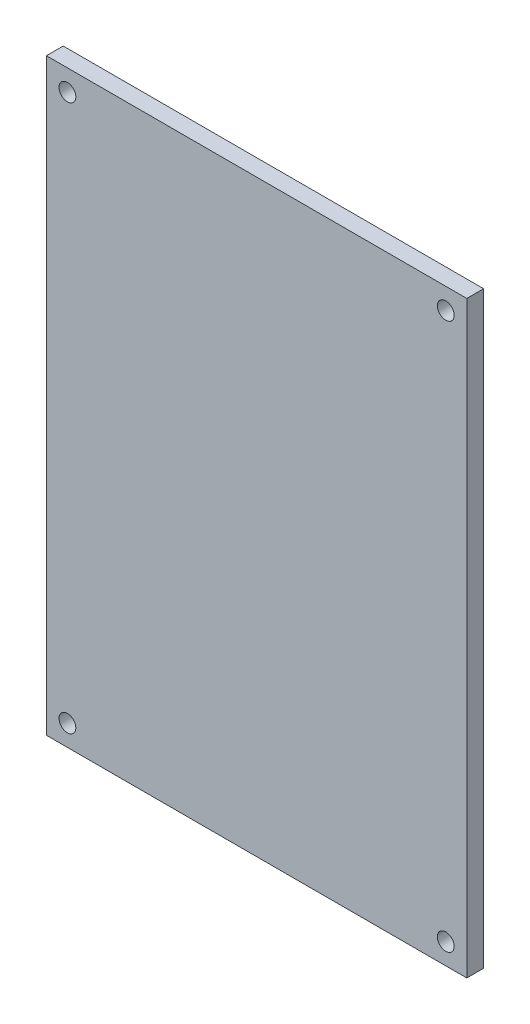
ISO-10303-21;
HEADER;
FILE_DESCRIPTION(('STEP AP214'),'2;1');
FILE_NAME('part.step','',(''),(''),'','','');
FILE_SCHEMA(('AUTOMOTIVE_DESIGN { 1 0 10303 214 1 1 1 1 }'));
ENDSEC;
DATA;
#1=APPLICATION_CONTEXT('core data for automotive mechanical design processes');
#2=APPLICATION_PROTOCOL_DEFINITION('international standard','automotive_design',2000,#1);
#3=PRODUCT_CONTEXT('',#1,'mechanical');
#4=PRODUCT('Part','Part','',(#3));
#5=PRODUCT_RELATED_PRODUCT_CATEGORY('part','',(#4));
#6=PRODUCT_DEFINITION_FORMATION('','',#4);
#7=PRODUCT_DEFINITION_CONTEXT('part definition',#1,'design');
#8=PRODUCT_DEFINITION('design','',#6,#7);
#9=PRODUCT_DEFINITION_SHAPE('','',#8);
#10=(LENGTH_UNIT() NAMED_UNIT(*) SI_UNIT(.MILLI.,.METRE.));
#11=(NAMED_UNIT(*) PLANE_ANGLE_UNIT() SI_UNIT($,.RADIAN.));
#12=(NAMED_UNIT(*) SI_UNIT($,.STERADIAN.) SOLID_ANGLE_UNIT());
#13=UNCERTAINTY_MEASURE_WITH_UNIT(LENGTH_MEASURE(1.E-05),#10,'distance_accuracy_value','');
#14=(GEOMETRIC_REPRESENTATION_CONTEXT(3) GLOBAL_UNCERTAINTY_ASSIGNED_CONTEXT((#13)) GLOBAL_UNIT_ASSIGNED_CONTEXT((#10,
#11,#12)) REPRESENTATION_CONTEXT('',''));
#15=CARTESIAN_POINT('',(0.,0.,0.));
#16=DIRECTION('',(0.,0.,1.));
#17=DIRECTION('',(1.,0.,0.));
#18=AXIS2_PLACEMENT_3D('',#15,#16,#17);
#19=CARTESIAN_POINT('',(0.,0.,2.));
#20=DIRECTION('',(0.,0.,1.));
#21=DIRECTION('',(1.,0.,0.));
#22=AXIS2_PLACEMENT_3D('',#19,#20,#21);
#23=PLANE('',#22);
#24=CARTESIAN_POINT('',(22.5,-32.5,2.));
#25=DIRECTION('',(0.,0.,1.));
#26=DIRECTION('',(1.,0.,0.));
#27=AXIS2_PLACEMENT_3D('',#24,#25,#26);
#28=CIRCLE('',#27,1.);
#29=CARTESIAN_POINT('',(23.5,-32.5,2.));
#30=VERTEX_POINT('',#29);
#31=EDGE_CURVE('E124',#30,#30,#28,.T.);
#32=ORIENTED_EDGE('',*,*,#31,.F.);
#33=EDGE_LOOP('',(#32));
#34=FACE_BOUND('',#33,.T.);
#35=CARTESIAN_POINT('',(-22.5,32.5,2.));
#36=DIRECTION('',(0.,0.,1.));
#37=DIRECTION('',(1.,0.,0.));
#38=AXIS2_PLACEMENT_3D('',#35,#36,#37);
#39=CIRCLE('',#38,1.);
#40=CARTESIAN_POINT('',(-21.5,32.5,2.));
#41=VERTEX_POINT('',#40);
#42=EDGE_CURVE('E103',#41,#41,#39,.T.);
#43=ORIENTED_EDGE('',*,*,#42,.F.);
#44=EDGE_LOOP('',(#43));
#45=FACE_BOUND('',#44,.T.);
#46=DIRECTION('',(0.,1.,0.));
#47=VECTOR('',#46,1.);
#48=CARTESIAN_POINT('',(25.,35.,2.));
#49=LINE('',#48,#47);
#50=CARTESIAN_POINT('',(25.,-35.,2.));
#51=VERTEX_POINT('',#50);
#52=CARTESIAN_POINT('',(25.,35.,2.));
#53=VERTEX_POINT('',#52);
#54=EDGE_CURVE('E88',#51,#53,#49,.T.);
#55=ORIENTED_EDGE('',*,*,#54,.T.);
#56=DIRECTION('',(-1.,0.,0.));
#57=VECTOR('',#56,1.);
#58=CARTESIAN_POINT('',(-25.,35.,2.));
#59=LINE('',#58,#57);
#60=CARTESIAN_POINT('',(-25.,35.,2.));
#61=VERTEX_POINT('',#60);
#62=EDGE_CURVE('E83',#53,#61,#59,.T.);
#63=ORIENTED_EDGE('',*,*,#62,.T.);
#64=DIRECTION('',(0.,-1.,0.));
#65=VECTOR('',#64,1.);
#66=CARTESIAN_POINT('',(-25.,35.,2.));
#67=LINE('',#66,#65);
#68=CARTESIAN_POINT('',(-25.,-35.,2.));
#69=VERTEX_POINT('',#68);
#70=EDGE_CURVE('E86',#61,#69,#67,.T.);
#71=ORIENTED_EDGE('',*,*,#70,.T.);
#72=DIRECTION('',(1.,0.,0.));
#73=VECTOR('',#72,1.);
#74=CARTESIAN_POINT('',(-25.,-35.,2.));
#75=LINE('',#74,#73);
#76=EDGE_CURVE('E53',#69,#51,#75,.T.);
#77=ORIENTED_EDGE('',*,*,#76,.T.);
#78=EDGE_LOOP('',(#55,#63,#71,#77));
#79=FACE_BOUND('',#78,.T.);
#80=CARTESIAN_POINT('',(22.5,32.5,2.));
#81=DIRECTION('',(0.,0.,1.));
#82=DIRECTION('',(-1.,0.,0.));
#83=AXIS2_PLACEMENT_3D('',#80,#81,#82);
#84=CIRCLE('',#83,1.);
#85=CARTESIAN_POINT('',(21.5,32.5,2.));
#86=VERTEX_POINT('',#85);
#87=EDGE_CURVE('E118',#86,#86,#84,.T.);
#88=ORIENTED_EDGE('',*,*,#87,.F.);
#89=EDGE_LOOP('',(#88));
#90=FACE_BOUND('',#89,.T.);
#91=CARTESIAN_POINT('',(-22.5,-32.5,2.));
#92=DIRECTION('',(0.,0.,1.));
#93=DIRECTION('',(-1.,0.,0.));
#94=AXIS2_PLACEMENT_3D('',#91,#92,#93);
#95=CIRCLE('',#94,1.);
#96=CARTESIAN_POINT('',(-23.5,-32.5,2.));
#97=VERTEX_POINT('',#96);
#98=EDGE_CURVE('E130',#97,#97,#95,.T.);
#99=ORIENTED_EDGE('',*,*,#98,.F.);
#100=EDGE_LOOP('',(#99));
#101=FACE_BOUND('',#100,.T.);
#102=ADVANCED_FACE('F36',(#34,#45,#79,#90,#101),#23,.T.);
#103=CARTESIAN_POINT('',(0.,0.,0.));
#104=DIRECTION('',(0.,0.,1.));
#105=DIRECTION('',(1.,0.,0.));
#106=AXIS2_PLACEMENT_3D('',#103,#104,#105);
#107=PLANE('',#106);
#108=DIRECTION('',(0.,1.,0.));
#109=VECTOR('',#108,1.);
#110=CARTESIAN_POINT('',(25.,35.,0.));
#111=LINE('',#110,#109);
#112=CARTESIAN_POINT('',(25.,-35.,0.));
#113=VERTEX_POINT('',#112);
#114=CARTESIAN_POINT('',(25.,35.,0.));
#115=VERTEX_POINT('',#114);
#116=EDGE_CURVE('E100',#113,#115,#111,.T.);
#117=ORIENTED_EDGE('',*,*,#116,.F.);
#118=DIRECTION('',(1.,0.,0.));
#119=VECTOR('',#118,1.);
#120=CARTESIAN_POINT('',(-25.,-35.,0.));
#121=LINE('',#120,#119);
#122=CARTESIAN_POINT('',(-25.,-35.,0.));
#123=VERTEX_POINT('',#122);
#124=EDGE_CURVE('E76',#123,#113,#121,.T.);
#125=ORIENTED_EDGE('',*,*,#124,.F.);
#126=DIRECTION('',(0.,-1.,0.));
#127=VECTOR('',#126,1.);
#128=CARTESIAN_POINT('',(-25.,35.,0.));
#129=LINE('',#128,#127);
#130=CARTESIAN_POINT('',(-25.,35.,0.));
#131=VERTEX_POINT('',#130);
#132=EDGE_CURVE('E70',#131,#123,#129,.T.);
#133=ORIENTED_EDGE('',*,*,#132,.F.);
#134=DIRECTION('',(-1.,0.,0.));
#135=VECTOR('',#134,1.);
#136=CARTESIAN_POINT('',(-25.,35.,0.));
#137=LINE('',#136,#135);
#138=EDGE_CURVE('E92',#115,#131,#137,.T.);
#139=ORIENTED_EDGE('',*,*,#138,.F.);
#140=EDGE_LOOP('',(#117,#125,#133,#139));
#141=FACE_BOUND('',#140,.T.);
#142=CARTESIAN_POINT('',(-22.5,32.5,0.));
#143=DIRECTION('',(0.,0.,1.));
#144=DIRECTION('',(1.,0.,0.));
#145=AXIS2_PLACEMENT_3D('',#142,#143,#144);
#146=CIRCLE('',#145,1.);
#147=CARTESIAN_POINT('',(-21.5,32.5,0.));
#148=VERTEX_POINT('',#147);
#149=EDGE_CURVE('E115',#148,#148,#146,.T.);
#150=ORIENTED_EDGE('',*,*,#149,.T.);
#151=EDGE_LOOP('',(#150));
#152=FACE_BOUND('',#151,.T.);
#153=CARTESIAN_POINT('',(22.5,32.5,0.));
#154=DIRECTION('',(0.,0.,1.));
#155=DIRECTION('',(-1.,0.,0.));
#156=AXIS2_PLACEMENT_3D('',#153,#154,#155);
#157=CIRCLE('',#156,1.);
#158=CARTESIAN_POINT('',(21.5,32.5,0.));
#159=VERTEX_POINT('',#158);
#160=EDGE_CURVE('E121',#159,#159,#157,.T.);
#161=ORIENTED_EDGE('',*,*,#160,.T.);
#162=EDGE_LOOP('',(#161));
#163=FACE_BOUND('',#162,.T.);
#164=CARTESIAN_POINT('',(22.5,-32.5,0.));
#165=DIRECTION('',(0.,0.,1.));
#166=DIRECTION('',(1.,0.,0.));
#167=AXIS2_PLACEMENT_3D('',#164,#165,#166);
#168=CIRCLE('',#167,1.);
#169=CARTESIAN_POINT('',(23.5,-32.5,0.));
#170=VERTEX_POINT('',#169);
#171=EDGE_CURVE('E127',#170,#170,#168,.T.);
#172=ORIENTED_EDGE('',*,*,#171,.T.);
#173=EDGE_LOOP('',(#172));
#174=FACE_BOUND('',#173,.T.);
#175=CARTESIAN_POINT('',(-22.5,-32.5,0.));
#176=DIRECTION('',(0.,0.,1.));
#177=DIRECTION('',(-1.,0.,0.));
#178=AXIS2_PLACEMENT_3D('',#175,#176,#177);
#179=CIRCLE('',#178,1.);
#180=CARTESIAN_POINT('',(-23.5,-32.5,0.));
#181=VERTEX_POINT('',#180);
#182=EDGE_CURVE('E133',#181,#181,#179,.T.);
#183=ORIENTED_EDGE('',*,*,#182,.T.);
#184=EDGE_LOOP('',(#183));
#185=FACE_BOUND('',#184,.T.);
#186=ADVANCED_FACE('F111',(#141,#152,#163,#174,#185),#107,.F.);
#187=CARTESIAN_POINT('',(25.,35.,2.));
#188=DIRECTION('',(-1.,0.,0.));
#189=DIRECTION('',(0.,-1.,0.));
#190=AXIS2_PLACEMENT_3D('',#187,#188,#189);
#191=PLANE('',#190);
#192=ORIENTED_EDGE('',*,*,#116,.T.);
#193=DIRECTION('',(0.,0.,-1.));
#194=VECTOR('',#193,1.);
#195=CARTESIAN_POINT('',(25.,35.,2.));
#196=LINE('',#195,#194);
#197=EDGE_CURVE('E11',#53,#115,#196,.T.);
#198=ORIENTED_EDGE('',*,*,#197,.F.);
#199=ORIENTED_EDGE('',*,*,#54,.F.);
#200=DIRECTION('',(0.,0.,-1.));
#201=VECTOR('',#200,1.);
#202=CARTESIAN_POINT('',(25.,-35.,2.));
#203=LINE('',#202,#201);
#204=EDGE_CURVE('E96',#51,#113,#203,.T.);
#205=ORIENTED_EDGE('',*,*,#204,.T.);
#206=EDGE_LOOP('',(#192,#198,#199,#205));
#207=FACE_BOUND('',#206,.T.);
#208=ADVANCED_FACE('F38',(#207),#191,.F.);
#209=CARTESIAN_POINT('',(-25.,35.,2.));
#210=DIRECTION('',(0.,-1.,0.));
#211=DIRECTION('',(1.,0.,0.));
#212=AXIS2_PLACEMENT_3D('',#209,#210,#211);
#213=PLANE('',#212);
#214=ORIENTED_EDGE('',*,*,#138,.T.);
#215=DIRECTION('',(0.,0.,-1.));
#216=VECTOR('',#215,1.);
#217=CARTESIAN_POINT('',(-25.,35.,2.));
#218=LINE('',#217,#216);
#219=EDGE_CURVE('E45',#61,#131,#218,.T.);
#220=ORIENTED_EDGE('',*,*,#219,.F.);
#221=ORIENTED_EDGE('',*,*,#62,.F.);
#222=ORIENTED_EDGE('',*,*,#197,.T.);
#223=EDGE_LOOP('',(#214,#220,#221,#222));
#224=FACE_BOUND('',#223,.T.);
#225=ADVANCED_FACE('F91',(#224),#213,.F.);
#226=CARTESIAN_POINT('',(-25.,35.,2.));
#227=DIRECTION('',(1.,0.,0.));
#228=DIRECTION('',(0.,1.,0.));
#229=AXIS2_PLACEMENT_3D('',#226,#227,#228);
#230=PLANE('',#229);
#231=ORIENTED_EDGE('',*,*,#132,.T.);
#232=DIRECTION('',(0.,0.,-1.));
#233=VECTOR('',#232,1.);
#234=CARTESIAN_POINT('',(-25.,-35.,2.));
#235=LINE('',#234,#233);
#236=EDGE_CURVE('E93',#69,#123,#235,.T.);
#237=ORIENTED_EDGE('',*,*,#236,.F.);
#238=ORIENTED_EDGE('',*,*,#70,.F.);
#239=ORIENTED_EDGE('',*,*,#219,.T.);
#240=EDGE_LOOP('',(#231,#237,#238,#239));
#241=FACE_BOUND('',#240,.T.);
#242=ADVANCED_FACE('F94',(#241),#230,.F.);
#243=CARTESIAN_POINT('',(-25.,-35.,2.));
#244=DIRECTION('',(0.,1.,0.));
#245=DIRECTION('',(0.,0.,1.));
#246=AXIS2_PLACEMENT_3D('',#243,#244,#245);
#247=PLANE('',#246);
#248=ORIENTED_EDGE('',*,*,#124,.T.);
#249=ORIENTED_EDGE('',*,*,#204,.F.);
#250=ORIENTED_EDGE('',*,*,#76,.F.);
#251=ORIENTED_EDGE('',*,*,#236,.T.);
#252=EDGE_LOOP('',(#248,#249,#250,#251));
#253=FACE_BOUND('',#252,.T.);
#254=ADVANCED_FACE('F108',(#253),#247,.F.);
#255=CARTESIAN_POINT('',(-22.5,32.5,2.));
#256=DIRECTION('',(0.,0.,-1.));
#257=DIRECTION('',(-1.,0.,0.));
#258=AXIS2_PLACEMENT_3D('',#255,#256,#257);
#259=CYLINDRICAL_SURFACE('',#258,1.);
#260=ORIENTED_EDGE('',*,*,#42,.T.);
#261=EDGE_LOOP('',(#260));
#262=FACE_BOUND('',#261,.T.);
#263=ORIENTED_EDGE('',*,*,#149,.F.);
#264=EDGE_LOOP('',(#263));
#265=FACE_BOUND('',#264,.T.);
#266=ADVANCED_FACE('F152',(#262,#265),#259,.F.);
#267=CARTESIAN_POINT('',(22.5,32.5,2.));
#268=DIRECTION('',(0.,0.,-1.));
#269=DIRECTION('',(-1.,0.,0.));
#270=AXIS2_PLACEMENT_3D('',#267,#268,#269);
#271=CYLINDRICAL_SURFACE('',#270,1.);
#272=ORIENTED_EDGE('',*,*,#87,.T.);
#273=EDGE_LOOP('',(#272));
#274=FACE_BOUND('',#273,.T.);
#275=ORIENTED_EDGE('',*,*,#160,.F.);
#276=EDGE_LOOP('',(#275));
#277=FACE_BOUND('',#276,.T.);
#278=ADVANCED_FACE('F198',(#274,#277),#271,.F.);
#279=CARTESIAN_POINT('',(22.5,-32.5,2.));
#280=DIRECTION('',(0.,0.,-1.));
#281=DIRECTION('',(-1.,0.,0.));
#282=AXIS2_PLACEMENT_3D('',#279,#280,#281);
#283=CYLINDRICAL_SURFACE('',#282,1.);
#284=ORIENTED_EDGE('',*,*,#31,.T.);
#285=EDGE_LOOP('',(#284));
#286=FACE_BOUND('',#285,.T.);
#287=ORIENTED_EDGE('',*,*,#171,.F.);
#288=EDGE_LOOP('',(#287));
#289=FACE_BOUND('',#288,.T.);
#290=ADVANCED_FACE('F206',(#286,#289),#283,.F.);
#291=CARTESIAN_POINT('',(-22.5,-32.5,2.));
#292=DIRECTION('',(0.,0.,-1.));
#293=DIRECTION('',(-1.,0.,0.));
#294=AXIS2_PLACEMENT_3D('',#291,#292,#293);
#295=CYLINDRICAL_SURFACE('',#294,1.);
#296=ORIENTED_EDGE('',*,*,#98,.T.);
#297=EDGE_LOOP('',(#296));
#298=FACE_BOUND('',#297,.T.);
#299=ORIENTED_EDGE('',*,*,#182,.F.);
#300=EDGE_LOOP('',(#299));
#301=FACE_BOUND('',#300,.T.);
#302=ADVANCED_FACE('F139',(#298,#301),#295,.F.);
#303=CLOSED_SHELL('',(#102,#186,#208,#225,#242,#254,#266,#278,#290,#302));
#304=MANIFOLD_SOLID_BREP('B2',#303);
#305=ADVANCED_BREP_SHAPE_REPRESENTATION('',(#18,#304),#14);
#306=SHAPE_DEFINITION_REPRESENTATION(#9,#305);
ENDSEC;
END-ISO-10303-21;
